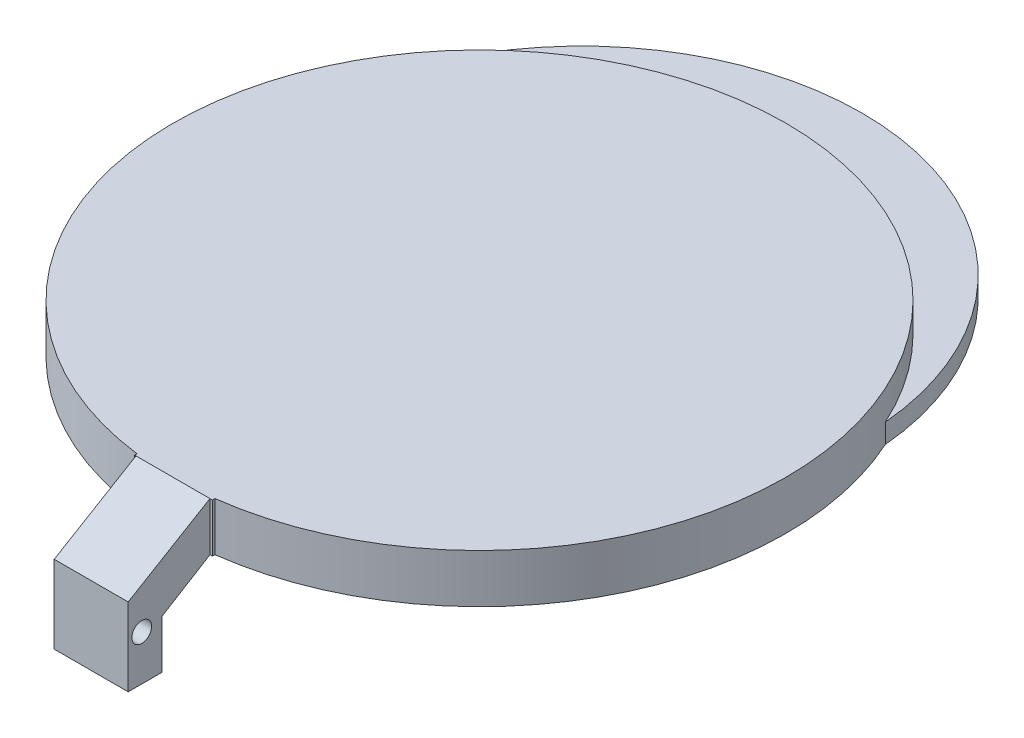
ISO-10303-21;
HEADER;
FILE_DESCRIPTION(('STEP AP214'),'2;1');
FILE_NAME('part.step','',(''),(''),'','','');
FILE_SCHEMA(('AUTOMOTIVE_DESIGN { 1 0 10303 214 1 1 1 1 }'));
ENDSEC;
DATA;
#1=APPLICATION_CONTEXT('core data for automotive mechanical design processes');
#2=APPLICATION_PROTOCOL_DEFINITION('international standard','automotive_design',2000,#1);
#3=PRODUCT_CONTEXT('',#1,'mechanical');
#4=PRODUCT('Part','Part','',(#3));
#5=PRODUCT_RELATED_PRODUCT_CATEGORY('part','',(#4));
#6=PRODUCT_DEFINITION_FORMATION('','',#4);
#7=PRODUCT_DEFINITION_CONTEXT('part definition',#1,'design');
#8=PRODUCT_DEFINITION('design','',#6,#7);
#9=PRODUCT_DEFINITION_SHAPE('','',#8);
#10=(LENGTH_UNIT() NAMED_UNIT(*) SI_UNIT(.MILLI.,.METRE.));
#11=(NAMED_UNIT(*) PLANE_ANGLE_UNIT() SI_UNIT($,.RADIAN.));
#12=(NAMED_UNIT(*) SI_UNIT($,.STERADIAN.) SOLID_ANGLE_UNIT());
#13=UNCERTAINTY_MEASURE_WITH_UNIT(LENGTH_MEASURE(1.E-05),#10,'distance_accuracy_value','');
#14=(GEOMETRIC_REPRESENTATION_CONTEXT(3) GLOBAL_UNCERTAINTY_ASSIGNED_CONTEXT((#13)) GLOBAL_UNIT_ASSIGNED_CONTEXT((#10,
#11,#12)) REPRESENTATION_CONTEXT('',''));
#15=CARTESIAN_POINT('',(0.,0.,0.));
#16=DIRECTION('',(0.,0.,1.));
#17=DIRECTION('',(1.,0.,0.));
#18=AXIS2_PLACEMENT_3D('',#15,#16,#17);
#19=CARTESIAN_POINT('',(-5.00856536586908,6.35,40.005));
#20=DIRECTION('',(0.,0.,1.));
#21=DIRECTION('',(1.,0.,0.));
#22=AXIS2_PLACEMENT_3D('',#19,#20,#21);
#23=PLANE('',#22);
#24=DIRECTION('',(-1.,0.,0.));
#25=VECTOR('',#24,1.);
#26=CARTESIAN_POINT('',(5.15143463413092,0.,40.005));
#27=LINE('',#26,#25);
#28=CARTESIAN_POINT('',(-4.826,0.,40.005));
#29=VERTEX_POINT('',#28);
#30=CARTESIAN_POINT('',(-5.00856536586908,0.,40.005));
#31=VERTEX_POINT('',#30);
#32=EDGE_CURVE('E66',#29,#31,#27,.T.);
#33=ORIENTED_EDGE('',*,*,#32,.F.);
#34=DIRECTION('',(0.,1.,0.));
#35=VECTOR('',#34,1.);
#36=CARTESIAN_POINT('',(-4.826,6.35,40.005));
#37=LINE('',#36,#35);
#38=CARTESIAN_POINT('',(-4.826,6.35,40.005));
#39=VERTEX_POINT('',#38);
#40=EDGE_CURVE('E61',#29,#39,#37,.T.);
#41=ORIENTED_EDGE('',*,*,#40,.T.);
#42=DIRECTION('',(1.,0.,0.));
#43=VECTOR('',#42,1.);
#44=CARTESIAN_POINT('',(5.15143463413092,6.35,40.005));
#45=LINE('',#44,#43);
#46=CARTESIAN_POINT('',(-5.00856536586908,6.35,40.005));
#47=VERTEX_POINT('',#46);
#48=EDGE_CURVE('E155',#47,#39,#45,.T.);
#49=ORIENTED_EDGE('',*,*,#48,.F.);
#50=DIRECTION('',(0.,1.,0.));
#51=VECTOR('',#50,1.);
#52=CARTESIAN_POINT('',(-5.00856536586908,0.,40.005));
#53=LINE('',#52,#51);
#54=EDGE_CURVE('E160',#31,#47,#53,.T.);
#55=ORIENTED_EDGE('',*,*,#54,.F.);
#56=EDGE_LOOP('',(#33,#41,#49,#55));
#57=FACE_BOUND('',#56,.T.);
#58=ADVANCED_FACE('F42',(#57),#23,.T.);
#59=CARTESIAN_POINT('',(0.,6.35,0.));
#60=DIRECTION('',(0.,-1.,0.));
#61=DIRECTION('',(0.,0.,-1.));
#62=AXIS2_PLACEMENT_3D('',#59,#60,#61);
#63=CYLINDRICAL_SURFACE('',#62,40.005);
#64=CARTESIAN_POINT('',(0.,0.,0.));
#65=DIRECTION('',(0.,1.,0.));
#66=DIRECTION('',(0.,0.,1.));
#67=AXIS2_PLACEMENT_3D('',#64,#65,#66);
#68=CIRCLE('',#67,40.005);
#69=CARTESIAN_POINT('',(-36.4392635079251,0.,-16.51));
#70=VERTEX_POINT('',#69);
#71=CARTESIAN_POINT('',(-5.00856536586908,0.,39.690229250734));
#72=VERTEX_POINT('',#71);
#73=EDGE_CURVE('E325',#70,#72,#68,.T.);
#74=ORIENTED_EDGE('',*,*,#73,.T.);
#75=DIRECTION('',(0.,-1.,0.));
#76=VECTOR('',#75,1.);
#77=CARTESIAN_POINT('',(-5.00856536586908,6.35,39.690229250734));
#78=LINE('',#77,#76);
#79=CARTESIAN_POINT('',(-5.00856536586908,6.35,39.690229250734));
#80=VERTEX_POINT('',#79);
#81=EDGE_CURVE('E288',#72,#80,#78,.F.);
#82=ORIENTED_EDGE('',*,*,#81,.T.);
#83=CARTESIAN_POINT('',(0.,6.35,0.));
#84=DIRECTION('',(0.,1.,0.));
#85=DIRECTION('',(0.,0.,1.));
#86=AXIS2_PLACEMENT_3D('',#83,#84,#85);
#87=CIRCLE('',#86,40.005);
#88=CARTESIAN_POINT('',(5.15143463413092,6.35,39.6719390276084));
#89=VERTEX_POINT('',#88);
#90=EDGE_CURVE('E53',#89,#80,#87,.T.);
#91=ORIENTED_EDGE('',*,*,#90,.F.);
#92=DIRECTION('',(0.,-1.,0.));
#93=VECTOR('',#92,1.);
#94=CARTESIAN_POINT('',(5.15143463413092,6.35,39.6719390276084));
#95=LINE('',#94,#93);
#96=CARTESIAN_POINT('',(5.15143463413092,0.,39.6719390276084));
#97=VERTEX_POINT('',#96);
#98=EDGE_CURVE('E292',#89,#97,#95,.T.);
#99=ORIENTED_EDGE('',*,*,#98,.T.);
#100=CARTESIAN_POINT('',(36.4392635079251,0.,-16.51));
#101=VERTEX_POINT('',#100);
#102=EDGE_CURVE('E324',#97,#101,#68,.T.);
#103=ORIENTED_EDGE('',*,*,#102,.T.);
#104=DIRECTION('',(0.,-1.,0.));
#105=VECTOR('',#104,1.);
#106=CARTESIAN_POINT('',(36.4392635079251,2.54,-16.51));
#107=LINE('',#106,#105);
#108=CARTESIAN_POINT('',(36.4392635079251,2.54,-16.51));
#109=VERTEX_POINT('',#108);
#110=EDGE_CURVE('E321',#109,#101,#107,.T.);
#111=ORIENTED_EDGE('',*,*,#110,.F.);
#112=CARTESIAN_POINT('',(0.,2.54,0.));
#113=DIRECTION('',(0.,1.,0.));
#114=DIRECTION('',(0.,0.,1.));
#115=AXIS2_PLACEMENT_3D('',#112,#113,#114);
#116=CIRCLE('',#115,40.005);
#117=CARTESIAN_POINT('',(-36.4392635079251,2.54,-16.51));
#118=VERTEX_POINT('',#117);
#119=EDGE_CURVE('E12',#109,#118,#116,.T.);
#120=ORIENTED_EDGE('',*,*,#119,.T.);
#121=DIRECTION('',(0.,-1.,0.));
#122=VECTOR('',#121,1.);
#123=CARTESIAN_POINT('',(-36.4392635079251,2.54,-16.51));
#124=LINE('',#123,#122);
#125=EDGE_CURVE('E316',#118,#70,#124,.T.);
#126=ORIENTED_EDGE('',*,*,#125,.T.);
#127=EDGE_LOOP('',(#74,#82,#91,#99,#103,#111,#120,#126));
#128=FACE_BOUND('',#127,.T.);
#129=ADVANCED_FACE('F44',(#128),#63,.T.);
#130=CARTESIAN_POINT('',(0.,6.35,0.));
#131=DIRECTION('',(0.,1.,0.));
#132=DIRECTION('',(0.,0.,1.));
#133=AXIS2_PLACEMENT_3D('',#130,#131,#132);
#134=PLANE('',#133);
#135=ORIENTED_EDGE('',*,*,#90,.T.);
#136=DIRECTION('',(0.,0.,1.));
#137=VECTOR('',#136,1.);
#138=CARTESIAN_POINT('',(-5.00856536586908,6.35,38.1));
#139=LINE('',#138,#137);
#140=EDGE_CURVE('E274',#80,#47,#139,.T.);
#141=ORIENTED_EDGE('',*,*,#140,.T.);
#142=ORIENTED_EDGE('',*,*,#48,.T.);
#143=CARTESIAN_POINT('',(4.826,6.35,40.005));
#144=DIRECTION('',(-1.,0.,0.));
#145=VECTOR('',#144,1.);
#146=LINE('',#143,#145);
#147=CARTESIAN_POINT('',(4.826,6.35,40.005));
#148=VERTEX_POINT('',#147);
#149=EDGE_CURVE('E145',#148,#39,#146,.T.);
#150=ORIENTED_EDGE('',*,*,#149,.F.);
#151=CARTESIAN_POINT('',(5.15143463413092,6.35,40.005));
#152=VERTEX_POINT('',#151);
#153=EDGE_CURVE('E151',#148,#152,#45,.T.);
#154=ORIENTED_EDGE('',*,*,#153,.T.);
#155=DIRECTION('',(0.,0.,1.));
#156=VECTOR('',#155,1.);
#157=CARTESIAN_POINT('',(5.15143463413092,6.35,38.1));
#158=LINE('',#157,#156);
#159=EDGE_CURVE('E265',#89,#152,#158,.T.);
#160=ORIENTED_EDGE('',*,*,#159,.F.);
#161=EDGE_LOOP('',(#135,#141,#142,#150,#154,#160));
#162=FACE_BOUND('',#161,.T.);
#163=ADVANCED_FACE('F149',(#162),#134,.T.);
#164=CARTESIAN_POINT('',(0.,0.,0.));
#165=DIRECTION('',(0.,1.,0.));
#166=DIRECTION('',(0.,0.,1.));
#167=AXIS2_PLACEMENT_3D('',#164,#165,#166);
#168=PLANE('',#167);
#169=ORIENTED_EDGE('',*,*,#102,.F.);
#170=DIRECTION('',(0.,0.,1.));
#171=VECTOR('',#170,1.);
#172=CARTESIAN_POINT('',(5.15143463413092,0.,38.1));
#173=LINE('',#172,#171);
#174=CARTESIAN_POINT('',(5.15143463413092,0.,40.005));
#175=VERTEX_POINT('',#174);
#176=EDGE_CURVE('E273',#97,#175,#173,.T.);
#177=ORIENTED_EDGE('',*,*,#176,.T.);
#178=CARTESIAN_POINT('',(4.826,0.,40.005));
#179=VERTEX_POINT('',#178);
#180=EDGE_CURVE('E198',#175,#179,#27,.T.);
#181=ORIENTED_EDGE('',*,*,#180,.T.);
#182=CARTESIAN_POINT('',(4.826,0.,40.005));
#183=DIRECTION('',(-1.,0.,0.));
#184=VECTOR('',#183,1.);
#185=LINE('',#182,#184);
#186=EDGE_CURVE('E369',#179,#29,#185,.T.);
#187=ORIENTED_EDGE('',*,*,#186,.T.);
#188=ORIENTED_EDGE('',*,*,#32,.T.);
#189=DIRECTION('',(0.,0.,1.));
#190=VECTOR('',#189,1.);
#191=CARTESIAN_POINT('',(-5.00856536586908,0.,38.1));
#192=LINE('',#191,#190);
#193=EDGE_CURVE('E287',#72,#31,#192,.T.);
#194=ORIENTED_EDGE('',*,*,#193,.F.);
#195=ORIENTED_EDGE('',*,*,#73,.F.);
#196=CARTESIAN_POINT('',(0.,0.,-13.3502767526255));
#197=DIRECTION('',(0.,1.,0.));
#198=DIRECTION('',(0.,0.,-1.));
#199=AXIS2_PLACEMENT_3D('',#196,#197,#198);
#200=CIRCLE('',#199,36.576);
#201=EDGE_CURVE('E296',#101,#70,#200,.T.);
#202=ORIENTED_EDGE('',*,*,#201,.F.);
#203=EDGE_LOOP('',(#169,#177,#181,#187,#188,#194,#195,#202));
#204=FACE_BOUND('',#203,.T.);
#205=CARTESIAN_POINT('',(0.,0.,-13.3502767526255));
#206=DIRECTION('',(0.,1.,0.));
#207=DIRECTION('',(0.,0.,1.));
#208=AXIS2_PLACEMENT_3D('',#205,#206,#207);
#209=CIRCLE('',#208,34.29);
#210=CARTESIAN_POINT('',(34.1933618899191,0.,-15.9228440821679));
#211=VERTEX_POINT('',#210);
#212=CARTESIAN_POINT('',(-34.1933618899191,0.,-15.9228440821679));
#213=VERTEX_POINT('',#212);
#214=EDGE_CURVE('E291',#211,#213,#209,.T.);
#215=ORIENTED_EDGE('',*,*,#214,.T.);
#216=CARTESIAN_POINT('',(0.,0.,0.));
#217=DIRECTION('',(0.,1.,0.));
#218=DIRECTION('',(0.,0.,1.));
#219=AXIS2_PLACEMENT_3D('',#216,#217,#218);
#220=CIRCLE('',#219,37.719);
#221=EDGE_CURVE('E304',#213,#211,#220,.T.);
#222=ORIENTED_EDGE('',*,*,#221,.T.);
#223=EDGE_LOOP('',(#215,#222));
#224=FACE_BOUND('',#223,.T.);
#225=ADVANCED_FACE('F347',(#204,#224),#168,.F.);
#226=CARTESIAN_POINT('',(0.,2.54,-6.67513837631273));
#227=DIRECTION('',(0.,1.,0.));
#228=DIRECTION('',(0.,0.,1.));
#229=AXIS2_PLACEMENT_3D('',#226,#227,#228);
#230=PLANE('',#229);
#231=ORIENTED_EDGE('',*,*,#119,.F.);
#232=CARTESIAN_POINT('',(0.,2.54,-13.3502767526255));
#233=DIRECTION('',(0.,1.,0.));
#234=DIRECTION('',(0.,0.,-1.));
#235=AXIS2_PLACEMENT_3D('',#232,#233,#234);
#236=CIRCLE('',#235,36.576);
#237=EDGE_CURVE('E313',#109,#118,#236,.T.);
#238=ORIENTED_EDGE('',*,*,#237,.T.);
#239=EDGE_LOOP('',(#231,#238));
#240=FACE_BOUND('',#239,.T.);
#241=ADVANCED_FACE('F352',(#240),#230,.T.);
#242=CARTESIAN_POINT('',(0.,2.54,-13.3502767526255));
#243=DIRECTION('',(0.,-1.,0.));
#244=DIRECTION('',(0.,0.,-1.));
#245=AXIS2_PLACEMENT_3D('',#242,#243,#244);
#246=CYLINDRICAL_SURFACE('',#245,36.576);
#247=ORIENTED_EDGE('',*,*,#201,.T.);
#248=ORIENTED_EDGE('',*,*,#125,.F.);
#249=ORIENTED_EDGE('',*,*,#237,.F.);
#250=ORIENTED_EDGE('',*,*,#110,.T.);
#251=EDGE_LOOP('',(#247,#248,#249,#250));
#252=FACE_BOUND('',#251,.T.);
#253=ADVANCED_FACE('F348',(#252),#246,.T.);
#254=CARTESIAN_POINT('',(0.,6.35,0.));
#255=DIRECTION('',(0.,-1.,0.));
#256=DIRECTION('',(0.,0.,-1.));
#257=AXIS2_PLACEMENT_3D('',#254,#255,#256);
#258=CYLINDRICAL_SURFACE('',#257,37.719);
#259=CARTESIAN_POINT('',(0.,0.254000000000001,0.));
#260=DIRECTION('',(0.,1.,0.));
#261=DIRECTION('',(0.,0.,1.));
#262=AXIS2_PLACEMENT_3D('',#259,#260,#261);
#263=CIRCLE('',#262,37.719);
#264=CARTESIAN_POINT('',(34.1933618899191,0.254,-15.9228440821679));
#265=VERTEX_POINT('',#264);
#266=CARTESIAN_POINT('',(-34.1933618899191,0.254,-15.9228440821679));
#267=VERTEX_POINT('',#266);
#268=EDGE_CURVE('E294',#265,#267,#263,.T.);
#269=ORIENTED_EDGE('',*,*,#268,.F.);
#270=DIRECTION('',(0.,-1.,0.));
#271=VECTOR('',#270,1.);
#272=CARTESIAN_POINT('',(34.1933618899191,0.254,-15.9228440821679));
#273=LINE('',#272,#271);
#274=EDGE_CURVE('E300',#265,#211,#273,.T.);
#275=ORIENTED_EDGE('',*,*,#274,.T.);
#276=ORIENTED_EDGE('',*,*,#221,.F.);
#277=DIRECTION('',(0.,-1.,0.));
#278=VECTOR('',#277,1.);
#279=CARTESIAN_POINT('',(-34.1933618899191,0.254,-15.9228440821679));
#280=LINE('',#279,#278);
#281=EDGE_CURVE('E298',#267,#213,#280,.T.);
#282=ORIENTED_EDGE('',*,*,#281,.F.);
#283=EDGE_LOOP('',(#269,#275,#276,#282));
#284=FACE_BOUND('',#283,.T.);
#285=CARTESIAN_POINT('',(0.,4.064,0.));
#286=DIRECTION('',(0.,1.,0.));
#287=DIRECTION('',(0.,0.,1.));
#288=AXIS2_PLACEMENT_3D('',#285,#286,#287);
#289=CIRCLE('',#288,37.719);
#290=CARTESIAN_POINT('',(0.,4.064,37.719));
#291=VERTEX_POINT('',#290);
#292=EDGE_CURVE('E297',#291,#291,#289,.T.);
#293=ORIENTED_EDGE('',*,*,#292,.T.);
#294=EDGE_LOOP('',(#293));
#295=FACE_BOUND('',#294,.T.);
#296=ADVANCED_FACE('F256',(#284,#295),#258,.F.);
#297=CARTESIAN_POINT('',(0.,4.064,0.));
#298=DIRECTION('',(0.,1.,0.));
#299=DIRECTION('',(0.,0.,1.));
#300=AXIS2_PLACEMENT_3D('',#297,#298,#299);
#301=PLANE('',#300);
#302=ORIENTED_EDGE('',*,*,#292,.F.);
#303=EDGE_LOOP('',(#302));
#304=FACE_BOUND('',#303,.T.);
#305=ADVANCED_FACE('F444',(#304),#301,.F.);
#306=CARTESIAN_POINT('',(0.,0.254,-6.67513837631273));
#307=DIRECTION('',(0.,1.,0.));
#308=DIRECTION('',(0.,0.,1.));
#309=AXIS2_PLACEMENT_3D('',#306,#307,#308);
#310=PLANE('',#309);
#311=ORIENTED_EDGE('',*,*,#268,.T.);
#312=CARTESIAN_POINT('',(0.,0.254,-13.3502767526255));
#313=DIRECTION('',(0.,1.,0.));
#314=DIRECTION('',(0.,0.,1.));
#315=AXIS2_PLACEMENT_3D('',#312,#313,#314);
#316=CIRCLE('',#315,34.29);
#317=EDGE_CURVE('E301',#265,#267,#316,.T.);
#318=ORIENTED_EDGE('',*,*,#317,.F.);
#319=EDGE_LOOP('',(#311,#318));
#320=FACE_BOUND('',#319,.T.);
#321=ADVANCED_FACE('F441',(#320),#310,.F.);
#322=CARTESIAN_POINT('',(0.,2.54,-13.3502767526255));
#323=DIRECTION('',(0.,-1.,0.));
#324=DIRECTION('',(0.,0.,-1.));
#325=AXIS2_PLACEMENT_3D('',#322,#323,#324);
#326=CYLINDRICAL_SURFACE('',#325,34.29);
#327=ORIENTED_EDGE('',*,*,#214,.F.);
#328=ORIENTED_EDGE('',*,*,#274,.F.);
#329=ORIENTED_EDGE('',*,*,#317,.T.);
#330=ORIENTED_EDGE('',*,*,#281,.T.);
#331=EDGE_LOOP('',(#327,#328,#329,#330));
#332=FACE_BOUND('',#331,.T.);
#333=ADVANCED_FACE('F252',(#332),#326,.F.);
#334=DIRECTION('',(0.,1.,0.));
#335=VECTOR('',#334,1.);
#336=CARTESIAN_POINT('',(4.826,6.35,40.005));
#337=LINE('',#336,#335);
#338=EDGE_CURVE('E169',#179,#148,#337,.T.);
#339=ORIENTED_EDGE('',*,*,#338,.F.);
#340=ORIENTED_EDGE('',*,*,#180,.F.);
#341=DIRECTION('',(0.,-1.,0.));
#342=VECTOR('',#341,1.);
#343=CARTESIAN_POINT('',(5.15143463413092,0.,40.005));
#344=LINE('',#343,#342);
#345=EDGE_CURVE('E172',#152,#175,#344,.T.);
#346=ORIENTED_EDGE('',*,*,#345,.F.);
#347=ORIENTED_EDGE('',*,*,#153,.F.);
#348=EDGE_LOOP('',(#339,#340,#346,#347));
#349=FACE_BOUND('',#348,.T.);
#350=ADVANCED_FACE('F166',(#349),#23,.T.);
#351=CARTESIAN_POINT('',(-5.00856536586908,0.,40.005));
#352=DIRECTION('',(-1.,0.,0.));
#353=DIRECTION('',(0.,0.,1.));
#354=AXIS2_PLACEMENT_3D('',#351,#352,#353);
#355=PLANE('',#354);
#356=ORIENTED_EDGE('',*,*,#81,.F.);
#357=ORIENTED_EDGE('',*,*,#193,.T.);
#358=ORIENTED_EDGE('',*,*,#54,.T.);
#359=ORIENTED_EDGE('',*,*,#140,.F.);
#360=EDGE_LOOP('',(#356,#357,#358,#359));
#361=FACE_BOUND('',#360,.T.);
#362=ADVANCED_FACE('F251',(#361),#355,.T.);
#363=CARTESIAN_POINT('',(5.15143463413092,6.35,40.005));
#364=DIRECTION('',(1.,0.,0.));
#365=DIRECTION('',(0.,0.,-1.));
#366=AXIS2_PLACEMENT_3D('',#363,#364,#365);
#367=PLANE('',#366);
#368=ORIENTED_EDGE('',*,*,#98,.F.);
#369=ORIENTED_EDGE('',*,*,#159,.T.);
#370=ORIENTED_EDGE('',*,*,#345,.T.);
#371=ORIENTED_EDGE('',*,*,#176,.F.);
#372=EDGE_LOOP('',(#368,#369,#370,#371));
#373=FACE_BOUND('',#372,.T.);
#374=ADVANCED_FACE('F253',(#373),#367,.T.);
#375=CARTESIAN_POINT('',(4.826,6.35,40.005));
#376=DIRECTION('',(0.,-0.859292884409707,-0.511483859767683));
#377=DIRECTION('',(0.,0.511483859767683,-0.859292884409707));
#378=AXIS2_PLACEMENT_3D('',#375,#376,#377);
#379=PLANE('',#378);
#380=DIRECTION('',(0.,-0.511483859767683,0.859292884409707));
#381=VECTOR('',#380,1.);
#382=CARTESIAN_POINT('',(-4.826,6.35,40.005));
#383=LINE('',#382,#381);
#384=CARTESIAN_POINT('',(-4.826,0.,50.673));
#385=VERTEX_POINT('',#384);
#386=EDGE_CURVE('E218',#39,#385,#383,.T.);
#387=ORIENTED_EDGE('',*,*,#386,.T.);
#388=DIRECTION('',(-1.,0.,0.));
#389=VECTOR('',#388,1.);
#390=CARTESIAN_POINT('',(4.826,0.,50.673));
#391=LINE('',#390,#389);
#392=CARTESIAN_POINT('',(4.826,0.,50.673));
#393=VERTEX_POINT('',#392);
#394=EDGE_CURVE('E161',#393,#385,#391,.T.);
#395=ORIENTED_EDGE('',*,*,#394,.F.);
#396=DIRECTION('',(0.,-0.511483859767683,0.859292884409707));
#397=VECTOR('',#396,1.);
#398=CARTESIAN_POINT('',(4.826,6.35,40.005));
#399=LINE('',#398,#397);
#400=EDGE_CURVE('E177',#148,#393,#399,.T.);
#401=ORIENTED_EDGE('',*,*,#400,.F.);
#402=ORIENTED_EDGE('',*,*,#149,.T.);
#403=EDGE_LOOP('',(#387,#395,#401,#402));
#404=FACE_BOUND('',#403,.T.);
#405=ADVANCED_FACE('F178',(#404),#379,.F.);
#406=CARTESIAN_POINT('',(4.826,0.,50.673));
#407=DIRECTION('',(0.,0.,-1.));
#408=DIRECTION('',(-1.,0.,0.));
#409=AXIS2_PLACEMENT_3D('',#406,#407,#408);
#410=PLANE('',#409);
#411=DIRECTION('',(0.,-1.,0.));
#412=VECTOR('',#411,1.);
#413=CARTESIAN_POINT('',(-4.826,0.,50.673));
#414=LINE('',#413,#412);
#415=CARTESIAN_POINT('',(-4.826,-10.16,50.673));
#416=VERTEX_POINT('',#415);
#417=EDGE_CURVE('E213',#385,#416,#414,.T.);
#418=ORIENTED_EDGE('',*,*,#417,.T.);
#419=DIRECTION('',(-1.,0.,0.));
#420=VECTOR('',#419,1.);
#421=CARTESIAN_POINT('',(4.826,-10.16,50.673));
#422=LINE('',#421,#420);
#423=CARTESIAN_POINT('',(4.826,-10.16,50.673));
#424=VERTEX_POINT('',#423);
#425=EDGE_CURVE('E613',#424,#416,#422,.T.);
#426=ORIENTED_EDGE('',*,*,#425,.F.);
#427=DIRECTION('',(0.,-1.,0.));
#428=VECTOR('',#427,1.);
#429=CARTESIAN_POINT('',(4.826,0.,50.673));
#430=LINE('',#429,#428);
#431=EDGE_CURVE('E182',#393,#424,#430,.T.);
#432=ORIENTED_EDGE('',*,*,#431,.F.);
#433=ORIENTED_EDGE('',*,*,#394,.T.);
#434=EDGE_LOOP('',(#418,#426,#432,#433));
#435=FACE_BOUND('',#434,.T.);
#436=ADVANCED_FACE('F407',(#435),#410,.F.);
#437=CARTESIAN_POINT('',(4.826,-10.16,50.673));
#438=DIRECTION('',(0.,1.,0.));
#439=DIRECTION('',(0.,0.,1.));
#440=AXIS2_PLACEMENT_3D('',#437,#438,#439);
#441=PLANE('',#440);
#442=DIRECTION('',(0.,0.,-1.));
#443=VECTOR('',#442,1.);
#444=CARTESIAN_POINT('',(-4.826,-10.16,50.673));
#445=LINE('',#444,#443);
#446=CARTESIAN_POINT('',(-4.826,-10.16,46.228));
#447=VERTEX_POINT('',#446);
#448=EDGE_CURVE('E601',#416,#447,#445,.T.);
#449=ORIENTED_EDGE('',*,*,#448,.T.);
#450=DIRECTION('',(-1.,0.,0.));
#451=VECTOR('',#450,1.);
#452=CARTESIAN_POINT('',(4.826,-10.16,46.228));
#453=LINE('',#452,#451);
#454=CARTESIAN_POINT('',(4.826,-10.16,46.228));
#455=VERTEX_POINT('',#454);
#456=EDGE_CURVE('E611',#455,#447,#453,.T.);
#457=ORIENTED_EDGE('',*,*,#456,.F.);
#458=DIRECTION('',(0.,0.,-1.));
#459=VECTOR('',#458,1.);
#460=CARTESIAN_POINT('',(4.826,-10.16,50.673));
#461=LINE('',#460,#459);
#462=EDGE_CURVE('E207',#424,#455,#461,.T.);
#463=ORIENTED_EDGE('',*,*,#462,.F.);
#464=ORIENTED_EDGE('',*,*,#425,.T.);
#465=EDGE_LOOP('',(#449,#457,#463,#464));
#466=FACE_BOUND('',#465,.T.);
#467=ADVANCED_FACE('F403',(#466),#441,.F.);
#468=CARTESIAN_POINT('',(4.826,-10.16,46.228));
#469=DIRECTION('',(0.,0.,1.));
#470=DIRECTION('',(1.,0.,0.));
#471=AXIS2_PLACEMENT_3D('',#468,#469,#470);
#472=PLANE('',#471);
#473=DIRECTION('',(0.,1.,0.));
#474=VECTOR('',#473,1.);
#475=CARTESIAN_POINT('',(-4.826,-10.16,46.228));
#476=LINE('',#475,#474);
#477=CARTESIAN_POINT('',(-4.826,-3.81,46.228));
#478=VERTEX_POINT('',#477);
#479=EDGE_CURVE('E192',#447,#478,#476,.T.);
#480=ORIENTED_EDGE('',*,*,#479,.T.);
#481=DIRECTION('',(-1.,0.,0.));
#482=VECTOR('',#481,1.);
#483=CARTESIAN_POINT('',(4.826,-3.81,46.228));
#484=LINE('',#483,#482);
#485=CARTESIAN_POINT('',(4.826,-3.81,46.228));
#486=VERTEX_POINT('',#485);
#487=EDGE_CURVE('E608',#486,#478,#484,.T.);
#488=ORIENTED_EDGE('',*,*,#487,.F.);
#489=DIRECTION('',(0.,1.,0.));
#490=VECTOR('',#489,1.);
#491=CARTESIAN_POINT('',(4.826,-10.16,46.228));
#492=LINE('',#491,#490);
#493=EDGE_CURVE('E209',#455,#486,#492,.T.);
#494=ORIENTED_EDGE('',*,*,#493,.F.);
#495=ORIENTED_EDGE('',*,*,#456,.T.);
#496=EDGE_LOOP('',(#480,#488,#494,#495));
#497=FACE_BOUND('',#496,.T.);
#498=ADVANCED_FACE('F397',(#497),#472,.F.);
#499=CARTESIAN_POINT('',(4.826,-3.81,46.228));
#500=DIRECTION('',(0.,0.852851304076266,0.52215385963853));
#501=DIRECTION('',(0.,-0.52215385963853,0.852851304076266));
#502=AXIS2_PLACEMENT_3D('',#499,#500,#501);
#503=PLANE('',#502);
#504=DIRECTION('',(0.,0.52215385963853,-0.852851304076265));
#505=VECTOR('',#504,1.);
#506=CARTESIAN_POINT('',(-4.826,-3.81,46.228));
#507=LINE('',#506,#505);
#508=EDGE_CURVE('E189',#478,#29,#507,.T.);
#509=ORIENTED_EDGE('',*,*,#508,.T.);
#510=ORIENTED_EDGE('',*,*,#186,.F.);
#511=DIRECTION('',(0.,0.52215385963853,-0.852851304076265));
#512=VECTOR('',#511,1.);
#513=CARTESIAN_POINT('',(4.826,-3.81,46.228));
#514=LINE('',#513,#512);
#515=EDGE_CURVE('E187',#486,#179,#514,.T.);
#516=ORIENTED_EDGE('',*,*,#515,.F.);
#517=ORIENTED_EDGE('',*,*,#487,.T.);
#518=EDGE_LOOP('',(#509,#510,#516,#517));
#519=FACE_BOUND('',#518,.T.);
#520=ADVANCED_FACE('F387',(#519),#503,.F.);
#521=CARTESIAN_POINT('',(4.826,-10.16,40.005));
#522=DIRECTION('',(1.,0.,0.));
#523=DIRECTION('',(0.,0.,-1.));
#524=AXIS2_PLACEMENT_3D('',#521,#522,#523);
#525=PLANE('',#524);
#526=CARTESIAN_POINT('',(4.826,-4.27592559493777,48.9021078942447));
#527=DIRECTION('',(1.,0.,0.));
#528=DIRECTION('',(0.,0.,-1.));
#529=AXIS2_PLACEMENT_3D('',#526,#527,#528);
#530=CIRCLE('',#529,1.293229199371);
#531=CARTESIAN_POINT('',(4.826,-4.27592559493777,47.6088786948737));
#532=VERTEX_POINT('',#531);
#533=EDGE_CURVE('E204',#532,#532,#530,.F.);
#534=ORIENTED_EDGE('',*,*,#533,.T.);
#535=EDGE_LOOP('',(#534));
#536=FACE_BOUND('',#535,.T.);
#537=ORIENTED_EDGE('',*,*,#338,.T.);
#538=ORIENTED_EDGE('',*,*,#400,.T.);
#539=ORIENTED_EDGE('',*,*,#431,.T.);
#540=ORIENTED_EDGE('',*,*,#462,.T.);
#541=ORIENTED_EDGE('',*,*,#493,.T.);
#542=ORIENTED_EDGE('',*,*,#515,.T.);
#543=EDGE_LOOP('',(#537,#538,#539,#540,#541,#542));
#544=FACE_BOUND('',#543,.T.);
#545=ADVANCED_FACE('F185',(#536,#544),#525,.T.);
#546=CARTESIAN_POINT('',(-4.826,-10.16,40.005));
#547=DIRECTION('',(1.,0.,0.));
#548=DIRECTION('',(0.,0.,-1.));
#549=AXIS2_PLACEMENT_3D('',#546,#547,#548);
#550=PLANE('',#549);
#551=CARTESIAN_POINT('',(-4.826,-4.27592559493777,48.9021078942447));
#552=DIRECTION('',(-1.,0.,0.));
#553=DIRECTION('',(0.,0.,1.));
#554=AXIS2_PLACEMENT_3D('',#551,#552,#553);
#555=CIRCLE('',#554,1.293229199371);
#556=CARTESIAN_POINT('',(-4.826,-4.27592559493777,50.1953370936157));
#557=VERTEX_POINT('',#556);
#558=EDGE_CURVE('E219',#557,#557,#555,.T.);
#559=ORIENTED_EDGE('',*,*,#558,.F.);
#560=EDGE_LOOP('',(#559));
#561=FACE_BOUND('',#560,.T.);
#562=ORIENTED_EDGE('',*,*,#40,.F.);
#563=ORIENTED_EDGE('',*,*,#508,.F.);
#564=ORIENTED_EDGE('',*,*,#479,.F.);
#565=ORIENTED_EDGE('',*,*,#448,.F.);
#566=ORIENTED_EDGE('',*,*,#417,.F.);
#567=ORIENTED_EDGE('',*,*,#386,.F.);
#568=EDGE_LOOP('',(#562,#563,#564,#565,#566,#567));
#569=FACE_BOUND('',#568,.T.);
#570=ADVANCED_FACE('F399',(#561,#569),#550,.F.);
#571=CARTESIAN_POINT('',(40.006,-4.27592559493777,48.9021078942447));
#572=DIRECTION('',(-1.,0.,0.));
#573=DIRECTION('',(0.,0.,1.));
#574=AXIS2_PLACEMENT_3D('',#571,#572,#573);
#575=CYLINDRICAL_SURFACE('',#574,1.293229199371);
#576=ORIENTED_EDGE('',*,*,#533,.F.);
#577=EDGE_LOOP('',(#576));
#578=FACE_BOUND('',#577,.T.);
#579=ORIENTED_EDGE('',*,*,#558,.T.);
#580=EDGE_LOOP('',(#579));
#581=FACE_BOUND('',#580,.T.);
#582=ADVANCED_FACE('F505',(#578,#581),#575,.F.);
#583=CLOSED_SHELL('',(#58,#129,#163,#225,#241,#253,#296,#305,#321,#333,#350,#362,#374,#405,#436,
#467,#498,#520,#545,#570,#582));
#584=MANIFOLD_SOLID_BREP('B2',#583);
#585=ADVANCED_BREP_SHAPE_REPRESENTATION('',(#18,#584),#14);
#586=SHAPE_DEFINITION_REPRESENTATION(#9,#585);
ENDSEC;
END-ISO-10303-21;
